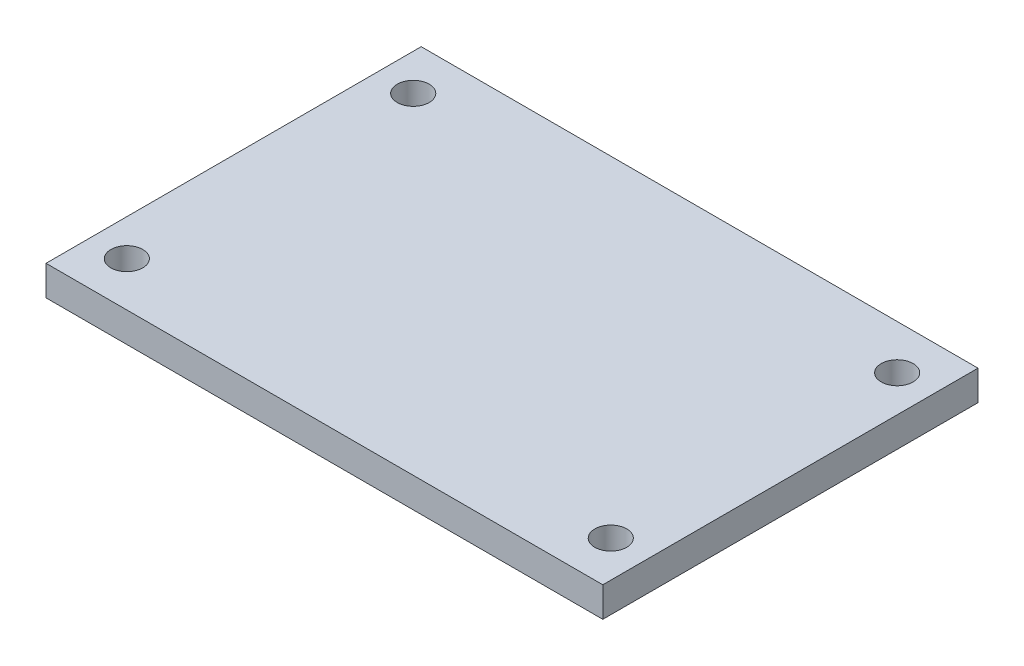
ISO-10303-21;
HEADER;
FILE_DESCRIPTION(('STEP AP214'),'2;1');
FILE_NAME('part.step','',(''),(''),'','','');
FILE_SCHEMA(('AUTOMOTIVE_DESIGN { 1 0 10303 214 1 1 1 1 }'));
ENDSEC;
DATA;
#1=APPLICATION_CONTEXT('core data for automotive mechanical design processes');
#2=APPLICATION_PROTOCOL_DEFINITION('international standard','automotive_design',2000,#1);
#3=PRODUCT_CONTEXT('',#1,'mechanical');
#4=PRODUCT('Part','Part','',(#3));
#5=PRODUCT_RELATED_PRODUCT_CATEGORY('part','',(#4));
#6=PRODUCT_DEFINITION_FORMATION('','',#4);
#7=PRODUCT_DEFINITION_CONTEXT('part definition',#1,'design');
#8=PRODUCT_DEFINITION('design','',#6,#7);
#9=PRODUCT_DEFINITION_SHAPE('','',#8);
#10=(LENGTH_UNIT() NAMED_UNIT(*) SI_UNIT(.MILLI.,.METRE.));
#11=(NAMED_UNIT(*) PLANE_ANGLE_UNIT() SI_UNIT($,.RADIAN.));
#12=(NAMED_UNIT(*) SI_UNIT($,.STERADIAN.) SOLID_ANGLE_UNIT());
#13=UNCERTAINTY_MEASURE_WITH_UNIT(LENGTH_MEASURE(1.E-05),#10,'distance_accuracy_value','');
#14=(GEOMETRIC_REPRESENTATION_CONTEXT(3) GLOBAL_UNCERTAINTY_ASSIGNED_CONTEXT((#13)) GLOBAL_UNIT_ASSIGNED_CONTEXT((#10,
#11,#12)) REPRESENTATION_CONTEXT('',''));
#15=CARTESIAN_POINT('',(0.,0.,0.));
#16=DIRECTION('',(0.,0.,1.));
#17=DIRECTION('',(1.,0.,0.));
#18=AXIS2_PLACEMENT_3D('',#15,#16,#17);
#19=CARTESIAN_POINT('',(0.,3.,-37.6));
#20=DIRECTION('',(1.,0.,0.));
#21=DIRECTION('',(0.,0.,-1.));
#22=AXIS2_PLACEMENT_3D('',#19,#20,#21);
#23=PLANE('',#22);
#24=DIRECTION('',(0.,0.,1.));
#25=VECTOR('',#24,1.);
#26=CARTESIAN_POINT('',(0.,0.,-37.6));
#27=LINE('',#26,#25);
#28=CARTESIAN_POINT('',(0.,0.,-37.6));
#29=VERTEX_POINT('',#28);
#30=CARTESIAN_POINT('',(0.,0.,0.));
#31=VERTEX_POINT('',#30);
#32=EDGE_CURVE('E113',#29,#31,#27,.T.);
#33=ORIENTED_EDGE('',*,*,#32,.T.);
#34=DIRECTION('',(0.,-1.,0.));
#35=VECTOR('',#34,1.);
#36=CARTESIAN_POINT('',(0.,3.,0.));
#37=LINE('',#36,#35);
#38=CARTESIAN_POINT('',(0.,3.,0.));
#39=VERTEX_POINT('',#38);
#40=EDGE_CURVE('E11',#39,#31,#37,.T.);
#41=ORIENTED_EDGE('',*,*,#40,.F.);
#42=DIRECTION('',(0.,0.,1.));
#43=VECTOR('',#42,1.);
#44=CARTESIAN_POINT('',(0.,3.,-37.6));
#45=LINE('',#44,#43);
#46=CARTESIAN_POINT('',(0.,3.,-37.6));
#47=VERTEX_POINT('',#46);
#48=EDGE_CURVE('E95',#47,#39,#45,.T.);
#49=ORIENTED_EDGE('',*,*,#48,.F.);
#50=DIRECTION('',(0.,-1.,0.));
#51=VECTOR('',#50,1.);
#52=CARTESIAN_POINT('',(0.,3.,-37.6));
#53=LINE('',#52,#51);
#54=EDGE_CURVE('E62',#47,#29,#53,.T.);
#55=ORIENTED_EDGE('',*,*,#54,.T.);
#56=EDGE_LOOP('',(#33,#41,#49,#55));
#57=FACE_BOUND('',#56,.T.);
#58=ADVANCED_FACE('F45',(#57),#23,.F.);
#59=CARTESIAN_POINT('',(0.,3.,0.));
#60=DIRECTION('',(0.,0.,-1.));
#61=DIRECTION('',(-1.,0.,0.));
#62=AXIS2_PLACEMENT_3D('',#59,#60,#61);
#63=PLANE('',#62);
#64=DIRECTION('',(1.,0.,0.));
#65=VECTOR('',#64,1.);
#66=CARTESIAN_POINT('',(0.,0.,0.));
#67=LINE('',#66,#65);
#68=CARTESIAN_POINT('',(55.8000000000001,0.,0.));
#69=VERTEX_POINT('',#68);
#70=EDGE_CURVE('E101',#31,#69,#67,.T.);
#71=ORIENTED_EDGE('',*,*,#70,.T.);
#72=DIRECTION('',(0.,-1.,0.));
#73=VECTOR('',#72,1.);
#74=CARTESIAN_POINT('',(55.8000000000001,3.,0.));
#75=LINE('',#74,#73);
#76=CARTESIAN_POINT('',(55.8000000000001,3.,0.));
#77=VERTEX_POINT('',#76);
#78=EDGE_CURVE('E54',#77,#69,#75,.T.);
#79=ORIENTED_EDGE('',*,*,#78,.F.);
#80=DIRECTION('',(1.,0.,0.));
#81=VECTOR('',#80,1.);
#82=CARTESIAN_POINT('',(0.,3.,0.));
#83=LINE('',#82,#81);
#84=EDGE_CURVE('E87',#39,#77,#83,.T.);
#85=ORIENTED_EDGE('',*,*,#84,.F.);
#86=ORIENTED_EDGE('',*,*,#40,.T.);
#87=EDGE_LOOP('',(#71,#79,#85,#86));
#88=FACE_BOUND('',#87,.T.);
#89=ADVANCED_FACE('F100',(#88),#63,.F.);
#90=CARTESIAN_POINT('',(55.8,3.,-37.6000000000001));
#91=DIRECTION('',(1.,0.,0.));
#92=DIRECTION('',(0.,0.,-1.));
#93=AXIS2_PLACEMENT_3D('',#90,#91,#92);
#94=PLANE('',#93);
#95=DIRECTION('',(0.,0.,1.));
#96=VECTOR('',#95,1.);
#97=CARTESIAN_POINT('',(55.8,0.,-37.6000000000001));
#98=LINE('',#97,#96);
#99=CARTESIAN_POINT('',(55.8,0.,-37.6000000000001));
#100=VERTEX_POINT('',#99);
#101=EDGE_CURVE('E119',#100,#69,#98,.T.);
#102=ORIENTED_EDGE('',*,*,#101,.F.);
#103=DIRECTION('',(0.,-1.,0.));
#104=VECTOR('',#103,1.);
#105=CARTESIAN_POINT('',(55.8,3.,-37.6000000000001));
#106=LINE('',#105,#104);
#107=CARTESIAN_POINT('',(55.8,3.,-37.6000000000001));
#108=VERTEX_POINT('',#107);
#109=EDGE_CURVE('E76',#108,#100,#106,.T.);
#110=ORIENTED_EDGE('',*,*,#109,.F.);
#111=DIRECTION('',(0.,0.,1.));
#112=VECTOR('',#111,1.);
#113=CARTESIAN_POINT('',(55.8,3.,-37.6000000000001));
#114=LINE('',#113,#112);
#115=EDGE_CURVE('E94',#108,#77,#114,.T.);
#116=ORIENTED_EDGE('',*,*,#115,.T.);
#117=ORIENTED_EDGE('',*,*,#78,.T.);
#118=EDGE_LOOP('',(#102,#110,#116,#117));
#119=FACE_BOUND('',#118,.T.);
#120=ADVANCED_FACE('F105',(#119),#94,.T.);
#121=CARTESIAN_POINT('',(0.,3.,-37.6));
#122=DIRECTION('',(0.,0.,-1.));
#123=DIRECTION('',(-1.,0.,0.));
#124=AXIS2_PLACEMENT_3D('',#121,#122,#123);
#125=PLANE('',#124);
#126=DIRECTION('',(1.,0.,0.));
#127=VECTOR('',#126,1.);
#128=CARTESIAN_POINT('',(0.,0.,-37.6));
#129=LINE('',#128,#127);
#130=EDGE_CURVE('E122',#29,#100,#129,.T.);
#131=ORIENTED_EDGE('',*,*,#130,.F.);
#132=ORIENTED_EDGE('',*,*,#54,.F.);
#133=DIRECTION('',(1.,0.,0.));
#134=VECTOR('',#133,1.);
#135=CARTESIAN_POINT('',(0.,3.,-37.6));
#136=LINE('',#135,#134);
#137=EDGE_CURVE('E107',#47,#108,#136,.T.);
#138=ORIENTED_EDGE('',*,*,#137,.T.);
#139=ORIENTED_EDGE('',*,*,#109,.T.);
#140=EDGE_LOOP('',(#131,#132,#138,#139));
#141=FACE_BOUND('',#140,.T.);
#142=ADVANCED_FACE('F169',(#141),#125,.T.);
#143=CARTESIAN_POINT('',(0.,3.,0.));
#144=DIRECTION('',(0.,1.,0.));
#145=DIRECTION('',(0.,0.,1.));
#146=AXIS2_PLACEMENT_3D('',#143,#144,#145);
#147=PLANE('',#146);
#148=CARTESIAN_POINT('',(3.65000000000004,3.,-33.15));
#149=DIRECTION('',(0.,1.,0.));
#150=DIRECTION('',(0.,0.,1.));
#151=AXIS2_PLACEMENT_3D('',#148,#149,#150);
#152=CIRCLE('',#151,1.6);
#153=CARTESIAN_POINT('',(3.65000000000004,3.,-31.55));
#154=VERTEX_POINT('',#153);
#155=EDGE_CURVE('E159',#154,#154,#152,.T.);
#156=ORIENTED_EDGE('',*,*,#155,.F.);
#157=EDGE_LOOP('',(#156));
#158=FACE_BOUND('',#157,.T.);
#159=CARTESIAN_POINT('',(52.15,3.,-33.15));
#160=DIRECTION('',(0.,1.,0.));
#161=DIRECTION('',(0.,0.,1.));
#162=AXIS2_PLACEMENT_3D('',#159,#160,#161);
#163=CIRCLE('',#162,1.6);
#164=CARTESIAN_POINT('',(52.15,3.,-31.55));
#165=VERTEX_POINT('',#164);
#166=EDGE_CURVE('E151',#165,#165,#163,.T.);
#167=ORIENTED_EDGE('',*,*,#166,.F.);
#168=EDGE_LOOP('',(#167));
#169=FACE_BOUND('',#168,.T.);
#170=CARTESIAN_POINT('',(52.15,3.,-4.44999999999996));
#171=DIRECTION('',(0.,1.,0.));
#172=DIRECTION('',(0.,0.,1.));
#173=AXIS2_PLACEMENT_3D('',#170,#171,#172);
#174=CIRCLE('',#173,1.6);
#175=CARTESIAN_POINT('',(52.15,3.,-2.84999999999996));
#176=VERTEX_POINT('',#175);
#177=EDGE_CURVE('E143',#176,#176,#174,.T.);
#178=ORIENTED_EDGE('',*,*,#177,.F.);
#179=EDGE_LOOP('',(#178));
#180=FACE_BOUND('',#179,.T.);
#181=CARTESIAN_POINT('',(3.65000000000004,3.,-4.44999999999996));
#182=DIRECTION('',(0.,1.,0.));
#183=DIRECTION('',(0.,0.,1.));
#184=AXIS2_PLACEMENT_3D('',#181,#182,#183);
#185=CIRCLE('',#184,1.6);
#186=CARTESIAN_POINT('',(3.65000000000004,3.,-2.84999999999996));
#187=VERTEX_POINT('',#186);
#188=EDGE_CURVE('E135',#187,#187,#185,.T.);
#189=ORIENTED_EDGE('',*,*,#188,.F.);
#190=EDGE_LOOP('',(#189));
#191=FACE_BOUND('',#190,.T.);
#192=ORIENTED_EDGE('',*,*,#48,.T.);
#193=ORIENTED_EDGE('',*,*,#84,.T.);
#194=ORIENTED_EDGE('',*,*,#115,.F.);
#195=ORIENTED_EDGE('',*,*,#137,.F.);
#196=EDGE_LOOP('',(#192,#193,#194,#195));
#197=FACE_BOUND('',#196,.T.);
#198=ADVANCED_FACE('F91',(#158,#169,#180,#191,#197),#147,.T.);
#199=CARTESIAN_POINT('',(0.,0.,0.));
#200=DIRECTION('',(0.,1.,0.));
#201=DIRECTION('',(0.,0.,1.));
#202=AXIS2_PLACEMENT_3D('',#199,#200,#201);
#203=PLANE('',#202);
#204=CARTESIAN_POINT('',(3.65000000000004,0.,-33.15));
#205=DIRECTION('',(0.,1.,0.));
#206=DIRECTION('',(0.,0.,1.));
#207=AXIS2_PLACEMENT_3D('',#204,#205,#206);
#208=CIRCLE('',#207,1.6);
#209=CARTESIAN_POINT('',(3.65000000000004,0.,-31.55));
#210=VERTEX_POINT('',#209);
#211=EDGE_CURVE('E155',#210,#210,#208,.T.);
#212=ORIENTED_EDGE('',*,*,#211,.T.);
#213=EDGE_LOOP('',(#212));
#214=FACE_BOUND('',#213,.T.);
#215=CARTESIAN_POINT('',(52.15,0.,-33.15));
#216=DIRECTION('',(0.,1.,0.));
#217=DIRECTION('',(0.,0.,1.));
#218=AXIS2_PLACEMENT_3D('',#215,#216,#217);
#219=CIRCLE('',#218,1.6);
#220=CARTESIAN_POINT('',(52.15,0.,-31.55));
#221=VERTEX_POINT('',#220);
#222=EDGE_CURVE('E147',#221,#221,#219,.T.);
#223=ORIENTED_EDGE('',*,*,#222,.T.);
#224=EDGE_LOOP('',(#223));
#225=FACE_BOUND('',#224,.T.);
#226=CARTESIAN_POINT('',(52.15,0.,-4.44999999999996));
#227=DIRECTION('',(0.,1.,0.));
#228=DIRECTION('',(0.,0.,1.));
#229=AXIS2_PLACEMENT_3D('',#226,#227,#228);
#230=CIRCLE('',#229,1.6);
#231=CARTESIAN_POINT('',(52.15,0.,-2.84999999999996));
#232=VERTEX_POINT('',#231);
#233=EDGE_CURVE('E139',#232,#232,#230,.T.);
#234=ORIENTED_EDGE('',*,*,#233,.T.);
#235=EDGE_LOOP('',(#234));
#236=FACE_BOUND('',#235,.T.);
#237=CARTESIAN_POINT('',(3.65000000000004,0.,-4.44999999999996));
#238=DIRECTION('',(0.,1.,0.));
#239=DIRECTION('',(0.,0.,1.));
#240=AXIS2_PLACEMENT_3D('',#237,#238,#239);
#241=CIRCLE('',#240,1.6);
#242=CARTESIAN_POINT('',(3.65000000000004,0.,-2.84999999999996));
#243=VERTEX_POINT('',#242);
#244=EDGE_CURVE('E116',#243,#243,#241,.T.);
#245=ORIENTED_EDGE('',*,*,#244,.T.);
#246=EDGE_LOOP('',(#245));
#247=FACE_BOUND('',#246,.T.);
#248=ORIENTED_EDGE('',*,*,#32,.F.);
#249=ORIENTED_EDGE('',*,*,#130,.T.);
#250=ORIENTED_EDGE('',*,*,#101,.T.);
#251=ORIENTED_EDGE('',*,*,#70,.F.);
#252=EDGE_LOOP('',(#248,#249,#250,#251));
#253=FACE_BOUND('',#252,.T.);
#254=ADVANCED_FACE('F168',(#214,#225,#236,#247,#253),#203,.F.);
#255=CARTESIAN_POINT('',(3.65000000000004,3.,-4.44999999999996));
#256=DIRECTION('',(0.,1.,0.));
#257=DIRECTION('',(0.,0.,1.));
#258=AXIS2_PLACEMENT_3D('',#255,#256,#257);
#259=CYLINDRICAL_SURFACE('',#258,1.6);
#260=ORIENTED_EDGE('',*,*,#244,.F.);
#261=EDGE_LOOP('',(#260));
#262=FACE_BOUND('',#261,.T.);
#263=ORIENTED_EDGE('',*,*,#188,.T.);
#264=EDGE_LOOP('',(#263));
#265=FACE_BOUND('',#264,.T.);
#266=ADVANCED_FACE('F177',(#262,#265),#259,.F.);
#267=CARTESIAN_POINT('',(52.15,3.,-4.44999999999996));
#268=DIRECTION('',(0.,1.,0.));
#269=DIRECTION('',(0.,0.,1.));
#270=AXIS2_PLACEMENT_3D('',#267,#268,#269);
#271=CYLINDRICAL_SURFACE('',#270,1.6);
#272=ORIENTED_EDGE('',*,*,#233,.F.);
#273=EDGE_LOOP('',(#272));
#274=FACE_BOUND('',#273,.T.);
#275=ORIENTED_EDGE('',*,*,#177,.T.);
#276=EDGE_LOOP('',(#275));
#277=FACE_BOUND('',#276,.T.);
#278=ADVANCED_FACE('F179',(#274,#277),#271,.F.);
#279=CARTESIAN_POINT('',(52.15,3.,-33.15));
#280=DIRECTION('',(0.,1.,0.));
#281=DIRECTION('',(0.,0.,1.));
#282=AXIS2_PLACEMENT_3D('',#279,#280,#281);
#283=CYLINDRICAL_SURFACE('',#282,1.6);
#284=ORIENTED_EDGE('',*,*,#222,.F.);
#285=EDGE_LOOP('',(#284));
#286=FACE_BOUND('',#285,.T.);
#287=ORIENTED_EDGE('',*,*,#166,.T.);
#288=EDGE_LOOP('',(#287));
#289=FACE_BOUND('',#288,.T.);
#290=ADVANCED_FACE('F186',(#286,#289),#283,.F.);
#291=CARTESIAN_POINT('',(3.65000000000004,3.,-33.15));
#292=DIRECTION('',(0.,1.,0.));
#293=DIRECTION('',(0.,0.,1.));
#294=AXIS2_PLACEMENT_3D('',#291,#292,#293);
#295=CYLINDRICAL_SURFACE('',#294,1.6);
#296=ORIENTED_EDGE('',*,*,#211,.F.);
#297=EDGE_LOOP('',(#296));
#298=FACE_BOUND('',#297,.T.);
#299=ORIENTED_EDGE('',*,*,#155,.T.);
#300=EDGE_LOOP('',(#299));
#301=FACE_BOUND('',#300,.T.);
#302=ADVANCED_FACE('F164',(#298,#301),#295,.F.);
#303=CLOSED_SHELL('',(#58,#89,#120,#142,#198,#254,#266,#278,#290,#302));
#304=MANIFOLD_SOLID_BREP('B2',#303);
#305=ADVANCED_BREP_SHAPE_REPRESENTATION('',(#18,#304),#14);
#306=SHAPE_DEFINITION_REPRESENTATION(#9,#305);
ENDSEC;
END-ISO-10303-21;
